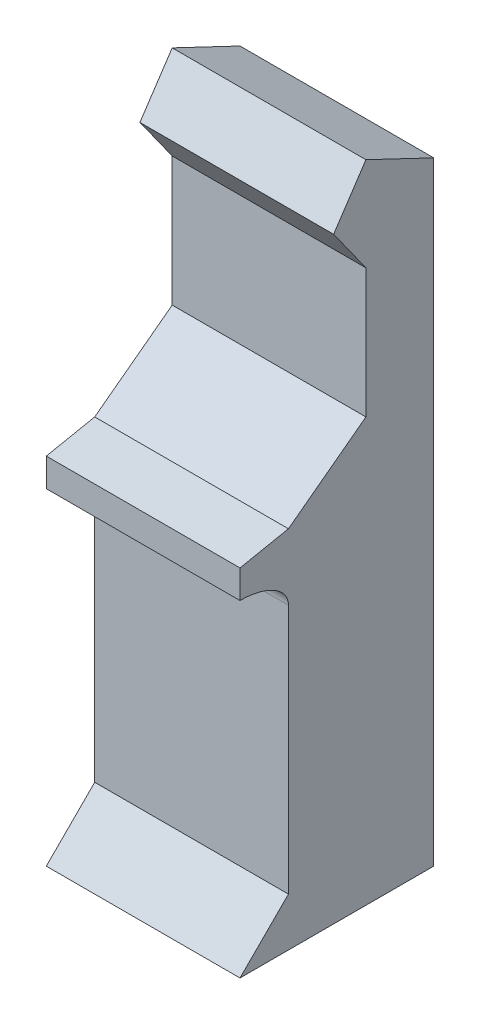
ISO-10303-21;
HEADER;
FILE_DESCRIPTION(('STEP AP214'),'2;1');
FILE_NAME('part.step','',(''),(''),'','','');
FILE_SCHEMA(('AUTOMOTIVE_DESIGN { 1 0 10303 214 1 1 1 1 }'));
ENDSEC;
DATA;
#1=APPLICATION_CONTEXT('core data for automotive mechanical design processes');
#2=APPLICATION_PROTOCOL_DEFINITION('international standard','automotive_design',2000,#1);
#3=PRODUCT_CONTEXT('',#1,'mechanical');
#4=PRODUCT('Part','Part','',(#3));
#5=PRODUCT_RELATED_PRODUCT_CATEGORY('part','',(#4));
#6=PRODUCT_DEFINITION_FORMATION('','',#4);
#7=PRODUCT_DEFINITION_CONTEXT('part definition',#1,'design');
#8=PRODUCT_DEFINITION('design','',#6,#7);
#9=PRODUCT_DEFINITION_SHAPE('','',#8);
#10=(LENGTH_UNIT() NAMED_UNIT(*) SI_UNIT(.MILLI.,.METRE.));
#11=(NAMED_UNIT(*) PLANE_ANGLE_UNIT() SI_UNIT($,.RADIAN.));
#12=(NAMED_UNIT(*) SI_UNIT($,.STERADIAN.) SOLID_ANGLE_UNIT());
#13=UNCERTAINTY_MEASURE_WITH_UNIT(LENGTH_MEASURE(1.E-05),#10,'distance_accuracy_value','');
#14=(GEOMETRIC_REPRESENTATION_CONTEXT(3) GLOBAL_UNCERTAINTY_ASSIGNED_CONTEXT((#13)) GLOBAL_UNIT_ASSIGNED_CONTEXT((#10,
#11,#12)) REPRESENTATION_CONTEXT('',''));
#15=CARTESIAN_POINT('',(0.,0.,0.));
#16=DIRECTION('',(0.,0.,1.));
#17=DIRECTION('',(1.,0.,0.));
#18=AXIS2_PLACEMENT_3D('',#15,#16,#17);
#19=CARTESIAN_POINT('',(-75.1906622899492,2000.,55.1398190126294));
#20=DIRECTION('',(-1.,0.,0.));
#21=DIRECTION('',(0.,0.,1.));
#22=AXIS2_PLACEMENT_3D('',#19,#20,#21);
#23=PLANE('',#22);
#24=DIRECTION('',(0.,-0.429933580392349,-0.90286051882393));
#25=VECTOR('',#24,1.);
#26=CARTESIAN_POINT('',(-75.1906622899492,1760.29692792486,-838.236632345171));
#27=LINE('',#26,#25);
#28=CARTESIAN_POINT('',(-75.1906622899492,2000.,-334.860180987371));
#29=VERTEX_POINT('',#28);
#30=CARTESIAN_POINT('',(-75.1906622899492,1900.,-544.860180987371));
#31=VERTEX_POINT('',#30);
#32=EDGE_CURVE('E131',#29,#31,#27,.T.);
#33=ORIENTED_EDGE('',*,*,#32,.T.);
#34=DIRECTION('',(0.,-1.,0.));
#35=VECTOR('',#34,1.);
#36=CARTESIAN_POINT('',(-75.1906622899492,2000.,-544.860180987371));
#37=LINE('',#36,#35);
#38=CARTESIAN_POINT('',(-75.1906622899492,0.,-544.860180987371));
#39=VERTEX_POINT('',#38);
#40=EDGE_CURVE('E41',#31,#39,#37,.T.);
#41=ORIENTED_EDGE('',*,*,#40,.T.);
#42=DIRECTION('',(0.,0.,-1.));
#43=VECTOR('',#42,1.);
#44=CARTESIAN_POINT('',(-75.1906622899492,0.,55.1398190126294));
#45=LINE('',#44,#43);
#46=CARTESIAN_POINT('',(-75.1906622899492,0.,55.1398190126294));
#47=VERTEX_POINT('',#46);
#48=EDGE_CURVE('E163',#47,#39,#45,.T.);
#49=ORIENTED_EDGE('',*,*,#48,.F.);
#50=DIRECTION('',(0.,0.707106781186548,-0.707106781186548));
#51=VECTOR('',#50,1.);
#52=CARTESIAN_POINT('',(-75.1906622899492,150.,-94.8601809873706));
#53=LINE('',#52,#51);
#54=CARTESIAN_POINT('',(-75.1906622899492,150.,-94.8601809873706));
#55=VERTEX_POINT('',#54);
#56=EDGE_CURVE('E181',#47,#55,#53,.T.);
#57=ORIENTED_EDGE('',*,*,#56,.T.);
#58=DIRECTION('',(0.,1.,0.));
#59=VECTOR('',#58,1.);
#60=CARTESIAN_POINT('',(-75.1906622899492,0.,-94.8601809873706));
#61=LINE('',#60,#59);
#62=CARTESIAN_POINT('',(-75.1906622899492,925.,-94.8601809873706));
#63=VERTEX_POINT('',#62);
#64=EDGE_CURVE('E168',#55,#63,#61,.T.);
#65=ORIENTED_EDGE('',*,*,#64,.T.);
#66=CARTESIAN_POINT('',(-75.1906622899492,925.,55.1398190126294));
#67=DIRECTION('',(1.,0.,0.));
#68=DIRECTION('',(0.,0.,1.));
#69=AXIS2_PLACEMENT_3D('',#66,#67,#68);
#70=ELLIPSE('',#69,150.,87.5000000000001);
#71=CARTESIAN_POINT('',(-75.1906622899492,1012.5,55.1398190126294));
#72=VERTEX_POINT('',#71);
#73=EDGE_CURVE('E206',#63,#72,#70,.T.);
#74=ORIENTED_EDGE('',*,*,#73,.T.);
#75=DIRECTION('',(0.,1.,0.));
#76=VECTOR('',#75,1.);
#77=CARTESIAN_POINT('',(-75.1906622899492,1000.,55.1398190126294));
#78=LINE('',#77,#76);
#79=CARTESIAN_POINT('',(-75.1906622899492,1100.,55.1398190126294));
#80=VERTEX_POINT('',#79);
#81=EDGE_CURVE('E188',#72,#80,#78,.T.);
#82=ORIENTED_EDGE('',*,*,#81,.T.);
#83=DIRECTION('',(0.,-0.196116135138183,0.98058067569092));
#84=VECTOR('',#83,1.);
#85=CARTESIAN_POINT('',(-75.1906622899492,1100.,55.1398190126294));
#86=LINE('',#85,#84);
#87=CARTESIAN_POINT('',(-75.1906622899492,1130.,-94.8601809873706));
#88=VERTEX_POINT('',#87);
#89=EDGE_CURVE('E488',#88,#80,#86,.T.);
#90=ORIENTED_EDGE('',*,*,#89,.F.);
#91=DIRECTION('',(0.,0.6,-0.8));
#92=VECTOR('',#91,1.);
#93=CARTESIAN_POINT('',(-75.1906622899492,1310.,-334.860180987371));
#94=LINE('',#93,#92);
#95=CARTESIAN_POINT('',(-75.1906622899492,1310.,-334.860180987371));
#96=VERTEX_POINT('',#95);
#97=EDGE_CURVE('E53',#88,#96,#94,.T.);
#98=ORIENTED_EDGE('',*,*,#97,.T.);
#99=DIRECTION('',(0.,1.,0.));
#100=VECTOR('',#99,1.);
#101=CARTESIAN_POINT('',(-75.1906622899492,1130.,-334.860180987371));
#102=LINE('',#101,#100);
#103=CARTESIAN_POINT('',(-75.1906622899492,1710.,-334.860180987371));
#104=VERTEX_POINT('',#103);
#105=EDGE_CURVE('E481',#96,#104,#102,.T.);
#106=ORIENTED_EDGE('',*,*,#105,.T.);
#107=DIRECTION('',(0.,-0.813733471206735,-0.581238193719096));
#108=VECTOR('',#107,1.);
#109=CARTESIAN_POINT('',(-75.1906622899492,736.082518034567,-1030.51552524839));
#110=LINE('',#109,#108);
#111=CARTESIAN_POINT('',(-75.1906622899492,1850.,-234.860180987371));
#112=VERTEX_POINT('',#111);
#113=EDGE_CURVE('E461',#112,#104,#110,.T.);
#114=ORIENTED_EDGE('',*,*,#113,.F.);
#115=DIRECTION('',(0.,-0.832050294337844,0.554700196225229));
#116=VECTOR('',#115,1.);
#117=CARTESIAN_POINT('',(-75.1906622899492,460.833762621214,691.25064393182));
#118=LINE('',#117,#116);
#119=EDGE_CURVE('E145',#29,#112,#118,.T.);
#120=ORIENTED_EDGE('',*,*,#119,.F.);
#121=EDGE_LOOP('',(#33,#41,#49,#57,#65,#74,#82,#90,#98,#106,#114,#120));
#122=FACE_BOUND('',#121,.T.);
#123=ADVANCED_FACE('F38',(#122),#23,.T.);
#124=CARTESIAN_POINT('',(524.809337710051,2000.,55.1398190126294));
#125=DIRECTION('',(-1.,0.,0.));
#126=DIRECTION('',(0.,0.,1.));
#127=AXIS2_PLACEMENT_3D('',#124,#125,#126);
#128=PLANE('',#127);
#129=DIRECTION('',(0.,-1.,0.));
#130=VECTOR('',#129,1.);
#131=CARTESIAN_POINT('',(524.809337710051,2000.,-544.860180987371));
#132=LINE('',#131,#130);
#133=CARTESIAN_POINT('',(524.809337710051,1900.,-544.860180987371));
#134=VERTEX_POINT('',#133);
#135=CARTESIAN_POINT('',(524.809337710051,0.,-544.860180987371));
#136=VERTEX_POINT('',#135);
#137=EDGE_CURVE('E11',#134,#136,#132,.T.);
#138=ORIENTED_EDGE('',*,*,#137,.F.);
#139=DIRECTION('',(0.,-0.429933580392349,-0.90286051882393));
#140=VECTOR('',#139,1.);
#141=CARTESIAN_POINT('',(524.809337710051,1760.29692792486,-838.236632345171));
#142=LINE('',#141,#140);
#143=CARTESIAN_POINT('',(524.809337710051,2000.,-334.860180987371));
#144=VERTEX_POINT('',#143);
#145=EDGE_CURVE('E134',#144,#134,#142,.T.);
#146=ORIENTED_EDGE('',*,*,#145,.F.);
#147=DIRECTION('',(0.,-0.832050294337844,0.554700196225229));
#148=VECTOR('',#147,1.);
#149=CARTESIAN_POINT('',(524.809337710051,460.833762621214,691.25064393182));
#150=LINE('',#149,#148);
#151=CARTESIAN_POINT('',(524.809337710051,1850.,-234.860180987371));
#152=VERTEX_POINT('',#151);
#153=EDGE_CURVE('E139',#144,#152,#150,.T.);
#154=ORIENTED_EDGE('',*,*,#153,.T.);
#155=DIRECTION('',(0.,-0.813733471206735,-0.581238193719096));
#156=VECTOR('',#155,1.);
#157=CARTESIAN_POINT('',(524.809337710051,736.082518034567,-1030.51552524839));
#158=LINE('',#157,#156);
#159=CARTESIAN_POINT('',(524.809337710051,1710.,-334.860180987371));
#160=VERTEX_POINT('',#159);
#161=EDGE_CURVE('E460',#152,#160,#158,.T.);
#162=ORIENTED_EDGE('',*,*,#161,.T.);
#163=DIRECTION('',(0.,1.,0.));
#164=VECTOR('',#163,1.);
#165=CARTESIAN_POINT('',(524.809337710051,1130.,-334.860180987371));
#166=LINE('',#165,#164);
#167=CARTESIAN_POINT('',(524.809337710051,1310.,-334.860180987371));
#168=VERTEX_POINT('',#167);
#169=EDGE_CURVE('E480',#168,#160,#166,.T.);
#170=ORIENTED_EDGE('',*,*,#169,.F.);
#171=DIRECTION('',(0.,0.6,-0.8));
#172=VECTOR('',#171,1.);
#173=CARTESIAN_POINT('',(524.809337710051,1310.,-334.860180987371));
#174=LINE('',#173,#172);
#175=CARTESIAN_POINT('',(524.809337710051,1130.,-94.8601809873706));
#176=VERTEX_POINT('',#175);
#177=EDGE_CURVE('E471',#176,#168,#174,.T.);
#178=ORIENTED_EDGE('',*,*,#177,.F.);
#179=DIRECTION('',(0.,-0.196116135138183,0.98058067569092));
#180=VECTOR('',#179,1.);
#181=CARTESIAN_POINT('',(524.809337710051,1100.,55.1398190126294));
#182=LINE('',#181,#180);
#183=CARTESIAN_POINT('',(524.809337710051,1100.,55.1398190126294));
#184=VERTEX_POINT('',#183);
#185=EDGE_CURVE('E484',#176,#184,#182,.T.);
#186=ORIENTED_EDGE('',*,*,#185,.T.);
#187=DIRECTION('',(0.,1.,0.));
#188=VECTOR('',#187,1.);
#189=CARTESIAN_POINT('',(524.809337710051,1000.,55.1398190126294));
#190=LINE('',#189,#188);
#191=CARTESIAN_POINT('',(524.809337710051,1012.5,55.1398190126294));
#192=VERTEX_POINT('',#191);
#193=EDGE_CURVE('E192',#192,#184,#190,.T.);
#194=ORIENTED_EDGE('',*,*,#193,.F.);
#195=CARTESIAN_POINT('',(524.809337710051,925.,55.1398190126294));
#196=DIRECTION('',(1.,0.,0.));
#197=DIRECTION('',(0.,0.,1.));
#198=AXIS2_PLACEMENT_3D('',#195,#196,#197);
#199=ELLIPSE('',#198,150.,87.5000000000001);
#200=CARTESIAN_POINT('',(524.809337710051,925.,-94.8601809873706));
#201=VERTEX_POINT('',#200);
#202=EDGE_CURVE('E207',#201,#192,#199,.T.);
#203=ORIENTED_EDGE('',*,*,#202,.F.);
#204=DIRECTION('',(0.,1.,0.));
#205=VECTOR('',#204,1.);
#206=CARTESIAN_POINT('',(524.809337710051,0.,-94.8601809873706));
#207=LINE('',#206,#205);
#208=CARTESIAN_POINT('',(524.809337710051,150.,-94.8601809873706));
#209=VERTEX_POINT('',#208);
#210=EDGE_CURVE('E169',#209,#201,#207,.T.);
#211=ORIENTED_EDGE('',*,*,#210,.F.);
#212=DIRECTION('',(0.,0.707106781186548,-0.707106781186548));
#213=VECTOR('',#212,1.);
#214=CARTESIAN_POINT('',(524.809337710051,150.,-94.8601809873706));
#215=LINE('',#214,#213);
#216=CARTESIAN_POINT('',(524.809337710051,0.,55.1398190126294));
#217=VERTEX_POINT('',#216);
#218=EDGE_CURVE('E184',#217,#209,#215,.T.);
#219=ORIENTED_EDGE('',*,*,#218,.F.);
#220=DIRECTION('',(0.,0.,-1.));
#221=VECTOR('',#220,1.);
#222=CARTESIAN_POINT('',(524.809337710051,0.,55.1398190126294));
#223=LINE('',#222,#221);
#224=EDGE_CURVE('E153',#217,#136,#223,.T.);
#225=ORIENTED_EDGE('',*,*,#224,.T.);
#226=EDGE_LOOP('',(#138,#146,#154,#162,#170,#178,#186,#194,#203,#211,#219,#225));
#227=FACE_BOUND('',#226,.T.);
#228=ADVANCED_FACE('F241',(#227),#128,.F.);
#229=CARTESIAN_POINT('',(-75.1906622899492,1130.,-334.860180987371));
#230=DIRECTION('',(0.,0.,-1.));
#231=DIRECTION('',(-1.,0.,0.));
#232=AXIS2_PLACEMENT_3D('',#229,#230,#231);
#233=PLANE('',#232);
#234=ORIENTED_EDGE('',*,*,#169,.T.);
#235=DIRECTION('',(1.,0.,0.));
#236=VECTOR('',#235,1.);
#237=CARTESIAN_POINT('',(-75.1906622899492,1710.,-334.860180987371));
#238=LINE('',#237,#236);
#239=EDGE_CURVE('E468',#104,#160,#238,.T.);
#240=ORIENTED_EDGE('',*,*,#239,.F.);
#241=ORIENTED_EDGE('',*,*,#105,.F.);
#242=DIRECTION('',(1.,0.,0.));
#243=VECTOR('',#242,1.);
#244=CARTESIAN_POINT('',(-75.1906622899492,1310.,-334.860180987371));
#245=LINE('',#244,#243);
#246=EDGE_CURVE('E474',#96,#168,#245,.T.);
#247=ORIENTED_EDGE('',*,*,#246,.T.);
#248=EDGE_LOOP('',(#234,#240,#241,#247));
#249=FACE_BOUND('',#248,.T.);
#250=ADVANCED_FACE('F236',(#249),#233,.F.);
#251=CARTESIAN_POINT('',(-75.1906622899492,0.,-94.8601809873706));
#252=DIRECTION('',(0.,0.,-1.));
#253=DIRECTION('',(-1.,0.,0.));
#254=AXIS2_PLACEMENT_3D('',#251,#252,#253);
#255=PLANE('',#254);
#256=DIRECTION('',(1.,0.,0.));
#257=VECTOR('',#256,1.);
#258=CARTESIAN_POINT('',(-75.1906622899492,925.,-94.8601809873706));
#259=LINE('',#258,#257);
#260=EDGE_CURVE('E196',#63,#201,#259,.T.);
#261=ORIENTED_EDGE('',*,*,#260,.F.);
#262=ORIENTED_EDGE('',*,*,#64,.F.);
#263=DIRECTION('',(1.,0.,0.));
#264=VECTOR('',#263,1.);
#265=CARTESIAN_POINT('',(-75.1906622899492,150.,-94.8601809873706));
#266=LINE('',#265,#264);
#267=EDGE_CURVE('E177',#55,#209,#266,.T.);
#268=ORIENTED_EDGE('',*,*,#267,.T.);
#269=ORIENTED_EDGE('',*,*,#210,.T.);
#270=EDGE_LOOP('',(#261,#262,#268,#269));
#271=FACE_BOUND('',#270,.T.);
#272=ADVANCED_FACE('F233',(#271),#255,.F.);
#273=CARTESIAN_POINT('',(-75.1906622899492,2000.,-544.860180987371));
#274=DIRECTION('',(0.,0.,-1.));
#275=DIRECTION('',(-1.,0.,0.));
#276=AXIS2_PLACEMENT_3D('',#273,#274,#275);
#277=PLANE('',#276);
#278=DIRECTION('',(1.,0.,0.));
#279=VECTOR('',#278,1.);
#280=CARTESIAN_POINT('',(-75.1906622899492,1900.,-544.860180987371));
#281=LINE('',#280,#279);
#282=EDGE_CURVE('E128',#31,#134,#281,.T.);
#283=ORIENTED_EDGE('',*,*,#282,.T.);
#284=ORIENTED_EDGE('',*,*,#137,.T.);
#285=DIRECTION('',(1.,0.,0.));
#286=VECTOR('',#285,1.);
#287=CARTESIAN_POINT('',(-75.1906622899492,0.,-544.860180987371));
#288=LINE('',#287,#286);
#289=EDGE_CURVE('E151',#39,#136,#288,.T.);
#290=ORIENTED_EDGE('',*,*,#289,.F.);
#291=ORIENTED_EDGE('',*,*,#40,.F.);
#292=EDGE_LOOP('',(#283,#284,#290,#291));
#293=FACE_BOUND('',#292,.T.);
#294=ADVANCED_FACE('F149',(#293),#277,.T.);
#295=CARTESIAN_POINT('',(0.,0.,0.));
#296=DIRECTION('',(0.,-1.,0.));
#297=DIRECTION('',(0.,0.,-1.));
#298=AXIS2_PLACEMENT_3D('',#295,#296,#297);
#299=PLANE('',#298);
#300=ORIENTED_EDGE('',*,*,#224,.F.);
#301=DIRECTION('',(1.,0.,0.));
#302=VECTOR('',#301,1.);
#303=CARTESIAN_POINT('',(-75.1906622899492,0.,55.1398190126294));
#304=LINE('',#303,#302);
#305=EDGE_CURVE('E173',#47,#217,#304,.T.);
#306=ORIENTED_EDGE('',*,*,#305,.F.);
#307=ORIENTED_EDGE('',*,*,#48,.T.);
#308=ORIENTED_EDGE('',*,*,#289,.T.);
#309=EDGE_LOOP('',(#300,#306,#307,#308));
#310=FACE_BOUND('',#309,.T.);
#311=ADVANCED_FACE('F231',(#310),#299,.T.);
#312=CARTESIAN_POINT('',(-75.1906622899492,150.,-94.8601809873706));
#313=DIRECTION('',(0.,-0.707106781186548,-0.707106781186548));
#314=DIRECTION('',(0.,0.707106781186548,-0.707106781186548));
#315=AXIS2_PLACEMENT_3D('',#312,#313,#314);
#316=PLANE('',#315);
#317=ORIENTED_EDGE('',*,*,#218,.T.);
#318=ORIENTED_EDGE('',*,*,#267,.F.);
#319=ORIENTED_EDGE('',*,*,#56,.F.);
#320=ORIENTED_EDGE('',*,*,#305,.T.);
#321=EDGE_LOOP('',(#317,#318,#319,#320));
#322=FACE_BOUND('',#321,.T.);
#323=ADVANCED_FACE('F227',(#322),#316,.F.);
#324=CARTESIAN_POINT('',(-75.1906622899492,1000.,55.1398190126294));
#325=DIRECTION('',(0.,0.,-1.));
#326=DIRECTION('',(-1.,0.,0.));
#327=AXIS2_PLACEMENT_3D('',#324,#325,#326);
#328=PLANE('',#327);
#329=ORIENTED_EDGE('',*,*,#193,.T.);
#330=DIRECTION('',(-1.,0.,0.));
#331=VECTOR('',#330,1.);
#332=CARTESIAN_POINT('',(3990.50446051011,1100.,55.1398190126294));
#333=LINE('',#332,#331);
#334=EDGE_CURVE('E61',#184,#80,#333,.T.);
#335=ORIENTED_EDGE('',*,*,#334,.T.);
#336=ORIENTED_EDGE('',*,*,#81,.F.);
#337=DIRECTION('',(1.,0.,0.));
#338=VECTOR('',#337,1.);
#339=CARTESIAN_POINT('',(-75.1906622899492,1012.5,55.1398190126294));
#340=LINE('',#339,#338);
#341=EDGE_CURVE('E202',#72,#192,#340,.T.);
#342=ORIENTED_EDGE('',*,*,#341,.T.);
#343=EDGE_LOOP('',(#329,#335,#336,#342));
#344=FACE_BOUND('',#343,.T.);
#345=ADVANCED_FACE('F222',(#344),#328,.F.);
#346=DIRECTION('',(1.,0.,0.));
#347=VECTOR('',#346,1.);
#348=SURFACE_OF_LINEAR_EXTRUSION('',#70,#347);
#349=ORIENTED_EDGE('',*,*,#73,.F.);
#350=ORIENTED_EDGE('',*,*,#260,.T.);
#351=ORIENTED_EDGE('',*,*,#202,.T.);
#352=ORIENTED_EDGE('',*,*,#341,.F.);
#353=EDGE_LOOP('',(#349,#350,#351,#352));
#354=FACE_BOUND('',#353,.T.);
#355=ADVANCED_FACE('F217',(#354),#348,.F.);
#356=CARTESIAN_POINT('',(3990.50446051011,1100.,55.1398190126294));
#357=DIRECTION('',(0.,0.98058067569092,0.196116135138183));
#358=DIRECTION('',(0.,-0.196116135138183,0.98058067569092));
#359=AXIS2_PLACEMENT_3D('',#356,#357,#358);
#360=PLANE('',#359);
#361=ORIENTED_EDGE('',*,*,#185,.F.);
#362=DIRECTION('',(1.,0.,0.));
#363=VECTOR('',#362,1.);
#364=CARTESIAN_POINT('',(-75.1906622899492,1130.,-94.8601809873706));
#365=LINE('',#364,#363);
#366=EDGE_CURVE('E210',#88,#176,#365,.T.);
#367=ORIENTED_EDGE('',*,*,#366,.F.);
#368=ORIENTED_EDGE('',*,*,#89,.T.);
#369=ORIENTED_EDGE('',*,*,#334,.F.);
#370=EDGE_LOOP('',(#361,#367,#368,#369));
#371=FACE_BOUND('',#370,.T.);
#372=ADVANCED_FACE('F221',(#371),#360,.T.);
#373=CARTESIAN_POINT('',(3990.50446051011,1310.,-334.860180987371));
#374=DIRECTION('',(0.,-0.8,-0.6));
#375=DIRECTION('',(0.,0.6,-0.8));
#376=AXIS2_PLACEMENT_3D('',#373,#374,#375);
#377=PLANE('',#376);
#378=ORIENTED_EDGE('',*,*,#177,.T.);
#379=ORIENTED_EDGE('',*,*,#246,.F.);
#380=ORIENTED_EDGE('',*,*,#97,.F.);
#381=ORIENTED_EDGE('',*,*,#366,.T.);
#382=EDGE_LOOP('',(#378,#379,#380,#381));
#383=FACE_BOUND('',#382,.T.);
#384=ADVANCED_FACE('F303',(#383),#377,.F.);
#385=CARTESIAN_POINT('',(-75.1906622899492,736.082518034567,-1030.51552524839));
#386=DIRECTION('',(0.,-0.581238193719096,0.813733471206735));
#387=DIRECTION('',(0.,-0.813733471206735,-0.581238193719096));
#388=AXIS2_PLACEMENT_3D('',#385,#386,#387);
#389=PLANE('',#388);
#390=ORIENTED_EDGE('',*,*,#161,.F.);
#391=DIRECTION('',(1.,0.,0.));
#392=VECTOR('',#391,1.);
#393=CARTESIAN_POINT('',(-75.1906622899492,1850.,-234.860180987371));
#394=LINE('',#393,#392);
#395=EDGE_CURVE('E449',#112,#152,#394,.T.);
#396=ORIENTED_EDGE('',*,*,#395,.F.);
#397=ORIENTED_EDGE('',*,*,#113,.T.);
#398=ORIENTED_EDGE('',*,*,#239,.T.);
#399=EDGE_LOOP('',(#390,#396,#397,#398));
#400=FACE_BOUND('',#399,.T.);
#401=ADVANCED_FACE('F311',(#400),#389,.T.);
#402=CARTESIAN_POINT('',(-75.1906622899492,460.833762621214,691.25064393182));
#403=DIRECTION('',(0.,0.554700196225229,0.832050294337844));
#404=DIRECTION('',(0.,-0.832050294337844,0.554700196225229));
#405=AXIS2_PLACEMENT_3D('',#402,#403,#404);
#406=PLANE('',#405);
#407=ORIENTED_EDGE('',*,*,#153,.F.);
#408=DIRECTION('',(1.,0.,0.));
#409=VECTOR('',#408,1.);
#410=CARTESIAN_POINT('',(-75.1906622899492,2000.,-334.860180987371));
#411=LINE('',#410,#409);
#412=EDGE_CURVE('E447',#29,#144,#411,.T.);
#413=ORIENTED_EDGE('',*,*,#412,.F.);
#414=ORIENTED_EDGE('',*,*,#119,.T.);
#415=ORIENTED_EDGE('',*,*,#395,.T.);
#416=EDGE_LOOP('',(#407,#413,#414,#415));
#417=FACE_BOUND('',#416,.T.);
#418=ADVANCED_FACE('F321',(#417),#406,.T.);
#419=CARTESIAN_POINT('',(-75.1906622899492,1760.29692792486,-838.236632345171));
#420=DIRECTION('',(0.,-0.90286051882393,0.429933580392348));
#421=DIRECTION('',(0.,-0.429933580392348,-0.90286051882393));
#422=AXIS2_PLACEMENT_3D('',#419,#420,#421);
#423=PLANE('',#422);
#424=ORIENTED_EDGE('',*,*,#145,.T.);
#425=ORIENTED_EDGE('',*,*,#282,.F.);
#426=ORIENTED_EDGE('',*,*,#32,.F.);
#427=ORIENTED_EDGE('',*,*,#412,.T.);
#428=EDGE_LOOP('',(#424,#425,#426,#427));
#429=FACE_BOUND('',#428,.T.);
#430=ADVANCED_FACE('F130',(#429),#423,.F.);
#431=CLOSED_SHELL('',(#123,#228,#250,#272,#294,#311,#323,#345,#355,#372,#384,#401,#418,#430));
#432=MANIFOLD_SOLID_BREP('B2',#431);
#433=ADVANCED_BREP_SHAPE_REPRESENTATION('',(#18,#432),#14);
#434=SHAPE_DEFINITION_REPRESENTATION(#9,#433);
ENDSEC;
END-ISO-10303-21;
